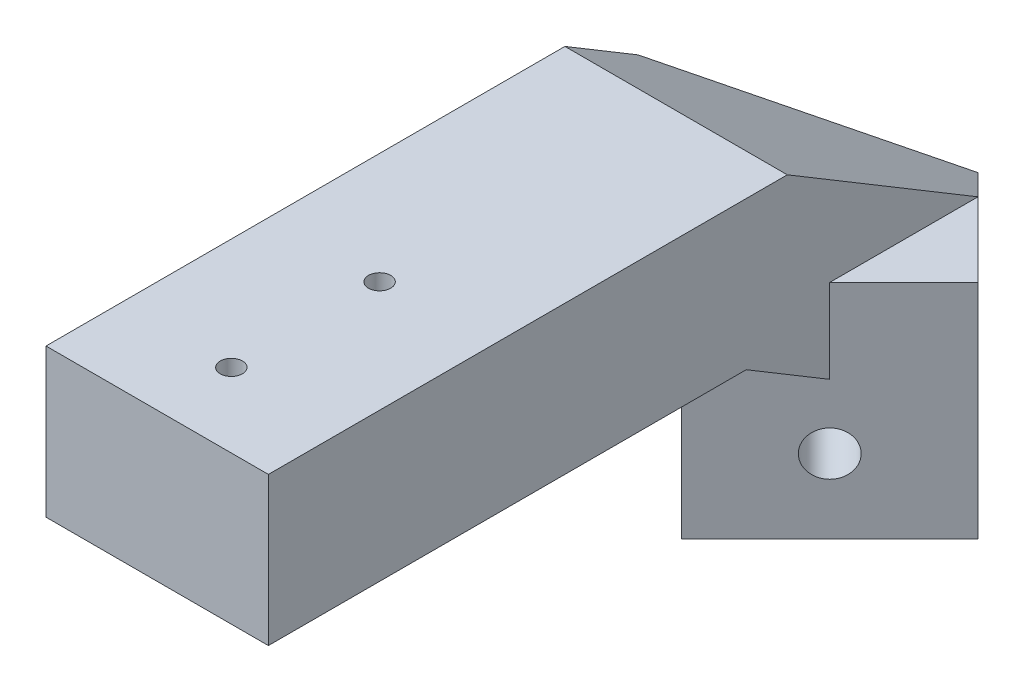
ISO-10303-21;
HEADER;
FILE_DESCRIPTION(('STEP AP214'),'2;1');
FILE_NAME('part.step','',(''),(''),'','','');
FILE_SCHEMA(('AUTOMOTIVE_DESIGN { 1 0 10303 214 1 1 1 1 }'));
ENDSEC;
DATA;
#1=APPLICATION_CONTEXT('core data for automotive mechanical design processes');
#2=APPLICATION_PROTOCOL_DEFINITION('international standard','automotive_design',2000,#1);
#3=PRODUCT_CONTEXT('',#1,'mechanical');
#4=PRODUCT('Part','Part','',(#3));
#5=PRODUCT_RELATED_PRODUCT_CATEGORY('part','',(#4));
#6=PRODUCT_DEFINITION_FORMATION('','',#4);
#7=PRODUCT_DEFINITION_CONTEXT('part definition',#1,'design');
#8=PRODUCT_DEFINITION('design','',#6,#7);
#9=PRODUCT_DEFINITION_SHAPE('','',#8);
#10=(LENGTH_UNIT() NAMED_UNIT(*) SI_UNIT(.MILLI.,.METRE.));
#11=(NAMED_UNIT(*) PLANE_ANGLE_UNIT() SI_UNIT($,.RADIAN.));
#12=(NAMED_UNIT(*) SI_UNIT($,.STERADIAN.) SOLID_ANGLE_UNIT());
#13=UNCERTAINTY_MEASURE_WITH_UNIT(LENGTH_MEASURE(1.E-05),#10,'distance_accuracy_value','');
#14=(GEOMETRIC_REPRESENTATION_CONTEXT(3) GLOBAL_UNCERTAINTY_ASSIGNED_CONTEXT((#13)) GLOBAL_UNIT_ASSIGNED_CONTEXT((#10,
#11,#12)) REPRESENTATION_CONTEXT('',''));
#15=CARTESIAN_POINT('',(0.,0.,0.));
#16=DIRECTION('',(0.,0.,1.));
#17=DIRECTION('',(1.,0.,0.));
#18=AXIS2_PLACEMENT_3D('',#15,#16,#17);
#19=CARTESIAN_POINT('',(30.,0.,0.));
#20=DIRECTION('',(0.,-1.,0.));
#21=DIRECTION('',(0.,0.,1.));
#22=AXIS2_PLACEMENT_3D('',#19,#20,#21);
#23=PLANE('',#22);
#24=CARTESIAN_POINT('',(15.,0.,-9.99999999999999));
#25=DIRECTION('',(0.,1.,0.));
#26=DIRECTION('',(0.,0.,1.));
#27=AXIS2_PLACEMENT_3D('',#24,#25,#26);
#28=CIRCLE('',#27,1.5);
#29=CARTESIAN_POINT('',(15.,0.,-8.49999999999999));
#30=VERTEX_POINT('',#29);
#31=EDGE_CURVE('E226',#30,#30,#28,.T.);
#32=ORIENTED_EDGE('',*,*,#31,.F.);
#33=EDGE_LOOP('',(#32));
#34=FACE_BOUND('',#33,.T.);
#35=CARTESIAN_POINT('',(15.,0.,10.));
#36=DIRECTION('',(0.,1.,0.));
#37=DIRECTION('',(0.,0.,1.));
#38=AXIS2_PLACEMENT_3D('',#35,#36,#37);
#39=CIRCLE('',#38,1.5);
#40=CARTESIAN_POINT('',(15.,0.,11.5));
#41=VERTEX_POINT('',#40);
#42=EDGE_CURVE('E133',#41,#41,#39,.T.);
#43=ORIENTED_EDGE('',*,*,#42,.F.);
#44=EDGE_LOOP('',(#43));
#45=FACE_BOUND('',#44,.T.);
#46=DIRECTION('',(0.,0.,-1.));
#47=VECTOR('',#46,1.);
#48=CARTESIAN_POINT('',(0.,0.,0.));
#49=LINE('',#48,#47);
#50=CARTESIAN_POINT('',(0.,0.,20.));
#51=VERTEX_POINT('',#50);
#52=CARTESIAN_POINT('',(0.,0.,-50.));
#53=VERTEX_POINT('',#52);
#54=EDGE_CURVE('E144',#51,#53,#49,.T.);
#55=ORIENTED_EDGE('',*,*,#54,.F.);
#56=DIRECTION('',(1.,0.,0.));
#57=VECTOR('',#56,1.);
#58=CARTESIAN_POINT('',(0.,0.,20.));
#59=LINE('',#58,#57);
#60=CARTESIAN_POINT('',(30.,0.,20.));
#61=VERTEX_POINT('',#60);
#62=EDGE_CURVE('E121',#51,#61,#59,.T.);
#63=ORIENTED_EDGE('',*,*,#62,.T.);
#64=DIRECTION('',(0.,0.,-1.));
#65=VECTOR('',#64,1.);
#66=CARTESIAN_POINT('',(30.,0.,0.));
#67=LINE('',#66,#65);
#68=CARTESIAN_POINT('',(30.,0.,-50.));
#69=VERTEX_POINT('',#68);
#70=EDGE_CURVE('E139',#61,#69,#67,.T.);
#71=ORIENTED_EDGE('',*,*,#70,.T.);
#72=DIRECTION('',(-1.,0.,0.));
#73=VECTOR('',#72,1.);
#74=CARTESIAN_POINT('',(30.,0.,-50.));
#75=LINE('',#74,#73);
#76=EDGE_CURVE('E150',#69,#53,#75,.T.);
#77=ORIENTED_EDGE('',*,*,#76,.T.);
#78=EDGE_LOOP('',(#55,#63,#71,#77));
#79=FACE_BOUND('',#78,.T.);
#80=ADVANCED_FACE('F32',(#34,#45,#79),#23,.F.);
#81=CARTESIAN_POINT('',(30.,0.,-50.));
#82=DIRECTION('',(0.,-0.857492925712545,0.514495755427526));
#83=DIRECTION('',(0.,0.514495755427526,0.857492925712545));
#84=AXIS2_PLACEMENT_3D('',#81,#82,#83);
#85=PLANE('',#84);
#86=ORIENTED_EDGE('',*,*,#76,.F.);
#87=DIRECTION('',(0.,-0.514495755427526,-0.857492925712544));
#88=VECTOR('',#87,1.);
#89=CARTESIAN_POINT('',(30.,0.,-50.));
#90=LINE('',#89,#88);
#91=CARTESIAN_POINT('',(30.,-15.4348726628258,-75.7247877713763));
#92=VERTEX_POINT('',#91);
#93=EDGE_CURVE('E142',#69,#92,#90,.T.);
#94=ORIENTED_EDGE('',*,*,#93,.T.);
#95=DIRECTION('',(0.650944554904121,0.390566732942471,0.650944554904118));
#96=VECTOR('',#95,1.);
#97=CARTESIAN_POINT('',(30.8474576271187,-14.9263980865546,-74.8773301442577));
#98=LINE('',#97,#96);
#99=CARTESIAN_POINT('',(22.9289321881345,-19.6775133499451,-82.7958555832418));
#100=VERTEX_POINT('',#99);
#101=EDGE_CURVE('E217',#100,#92,#98,.T.);
#102=ORIENTED_EDGE('',*,*,#101,.F.);
#103=DIRECTION('',(0.650944554904118,-0.390566732942472,-0.650944554904121));
#104=VECTOR('',#103,1.);
#105=CARTESIAN_POINT('',(-26.8724643293838,10.203324560566,-32.9944590657233));
#106=LINE('',#105,#104);
#107=CARTESIAN_POINT('',(0.,-5.92015403706431,-59.8669233951072));
#108=VERTEX_POINT('',#107);
#109=EDGE_CURVE('E11',#108,#100,#106,.T.);
#110=ORIENTED_EDGE('',*,*,#109,.F.);
#111=DIRECTION('',(0.,0.514495755427526,0.857492925712544));
#112=VECTOR('',#111,1.);
#113=CARTESIAN_POINT('',(0.,22.0588235294118,-13.235294117647));
#114=LINE('',#113,#112);
#115=EDGE_CURVE('E157',#108,#53,#114,.T.);
#116=ORIENTED_EDGE('',*,*,#115,.T.);
#117=EDGE_LOOP('',(#86,#94,#102,#110,#116));
#118=FACE_BOUND('',#117,.T.);
#119=ADVANCED_FACE('F240',(#118),#85,.F.);
#120=CARTESIAN_POINT('',(30.,-45.4348726628258,-75.7247877713763));
#121=DIRECTION('',(0.,1.,0.));
#122=DIRECTION('',(0.,0.,-1.));
#123=AXIS2_PLACEMENT_3D('',#120,#121,#122);
#124=PLANE('',#123);
#125=DIRECTION('',(-0.707106781186549,0.,-0.707106781186546));
#126=VECTOR('',#125,1.);
#127=CARTESIAN_POINT('',(40.,-45.4348726628258,-65.7247877713764));
#128=LINE('',#127,#126);
#129=CARTESIAN_POINT('',(40.,-45.4348726628258,-65.7247877713764));
#130=VERTEX_POINT('',#129);
#131=CARTESIAN_POINT('',(22.9289321881345,-45.4348726628258,-82.7958555832418));
#132=VERTEX_POINT('',#131);
#133=EDGE_CURVE('E184',#130,#132,#128,.T.);
#134=ORIENTED_EDGE('',*,*,#133,.F.);
#135=DIRECTION('',(0.707106781186546,0.,-0.707106781186549));
#136=VECTOR('',#135,1.);
#137=CARTESIAN_POINT('',(20.0000000000001,-45.4348726628258,-45.7247877713764));
#138=LINE('',#137,#136);
#139=CARTESIAN_POINT('',(20.0000000000001,-45.4348726628258,-45.7247877713764));
#140=VERTEX_POINT('',#139);
#141=EDGE_CURVE('E193',#140,#130,#138,.T.);
#142=ORIENTED_EDGE('',*,*,#141,.F.);
#143=DIRECTION('',(-0.707106781186549,0.,-0.707106781186546));
#144=VECTOR('',#143,1.);
#145=CARTESIAN_POINT('',(20.0000000000001,-45.4348726628258,-45.7247877713764));
#146=LINE('',#145,#144);
#147=CARTESIAN_POINT('',(2.9289321881346,-45.4348726628258,-62.7958555832418));
#148=VERTEX_POINT('',#147);
#149=EDGE_CURVE('E181',#140,#148,#146,.T.);
#150=ORIENTED_EDGE('',*,*,#149,.T.);
#151=DIRECTION('',(0.707106781186546,0.,-0.707106781186549));
#152=VECTOR('',#151,1.);
#153=CARTESIAN_POINT('',(2.9289321881346,-45.4348726628258,-62.7958555832418));
#154=LINE('',#153,#152);
#155=EDGE_CURVE('E202',#148,#132,#154,.T.);
#156=ORIENTED_EDGE('',*,*,#155,.T.);
#157=EDGE_LOOP('',(#134,#142,#150,#156));
#158=FACE_BOUND('',#157,.T.);
#159=ADVANCED_FACE('F260',(#158),#124,.F.);
#160=CARTESIAN_POINT('',(30.,-20.,-44.4603207010313));
#161=DIRECTION('',(0.,0.857492925712544,-0.514495755427526));
#162=DIRECTION('',(0.,-0.514495755427526,-0.857492925712545));
#163=AXIS2_PLACEMENT_3D('',#160,#161,#162);
#164=PLANE('',#163);
#165=DIRECTION('',(-0.650944554904118,0.390566732942472,0.650944554904121));
#166=VECTOR('',#165,1.);
#167=CARTESIAN_POINT('',(23.5086121967503,-22.8638475602572,-49.2333999681267));
#168=LINE('',#167,#166);
#169=CARTESIAN_POINT('',(30.,-26.758680242207,-55.7247877713763));
#170=VERTEX_POINT('',#169);
#171=CARTESIAN_POINT('',(20.0000000000001,-20.758680242207,-45.7247877713764));
#172=VERTEX_POINT('',#171);
#173=EDGE_CURVE('E174',#170,#172,#168,.T.);
#174=ORIENTED_EDGE('',*,*,#173,.F.);
#175=DIRECTION('',(0.,0.514495755427526,0.857492925712544));
#176=VECTOR('',#175,1.);
#177=CARTESIAN_POINT('',(30.,-20.,-44.4603207010313));
#178=LINE('',#177,#176);
#179=CARTESIAN_POINT('',(30.,-20.,-44.4603207010313));
#180=VERTEX_POINT('',#179);
#181=EDGE_CURVE('E165',#170,#180,#178,.T.);
#182=ORIENTED_EDGE('',*,*,#181,.T.);
#183=DIRECTION('',(-1.,0.,0.));
#184=VECTOR('',#183,1.);
#185=CARTESIAN_POINT('',(30.,-20.,-44.4603207010313));
#186=LINE('',#185,#184);
#187=CARTESIAN_POINT('',(0.,-20.,-44.4603207010313));
#188=VERTEX_POINT('',#187);
#189=EDGE_CURVE('E148',#180,#188,#186,.T.);
#190=ORIENTED_EDGE('',*,*,#189,.T.);
#191=DIRECTION('',(0.,0.514495755427526,0.857492925712544));
#192=VECTOR('',#191,1.);
#193=CARTESIAN_POINT('',(0.,-20.,-44.4603207010313));
#194=LINE('',#193,#192);
#195=CARTESIAN_POINT('',(0.,-20.7586802422069,-45.7247877713762));
#196=VERTEX_POINT('',#195);
#197=EDGE_CURVE('E137',#196,#188,#194,.T.);
#198=ORIENTED_EDGE('',*,*,#197,.F.);
#199=DIRECTION('',(-0.650944554904118,0.390566732942472,0.650944554904121));
#200=VECTOR('',#199,1.);
#201=CARTESIAN_POINT('',(11.9831884679368,-27.948593322969,-57.7079762393131));
#202=LINE('',#201,#200);
#203=CARTESIAN_POINT('',(10.0000000000001,-26.758680242207,-55.7247877713763));
#204=VERTEX_POINT('',#203);
#205=EDGE_CURVE('E159',#204,#196,#202,.T.);
#206=ORIENTED_EDGE('',*,*,#205,.F.);
#207=DIRECTION('',(-0.650944554904121,-0.390566732942471,-0.650944554904118));
#208=VECTOR('',#207,1.);
#209=CARTESIAN_POINT('',(24.9659640744362,-17.7791017975454,-40.7588236969403));
#210=LINE('',#209,#208);
#211=EDGE_CURVE('E161',#172,#204,#210,.T.);
#212=ORIENTED_EDGE('',*,*,#211,.F.);
#213=EDGE_LOOP('',(#174,#182,#190,#198,#206,#212));
#214=FACE_BOUND('',#213,.T.);
#215=ADVANCED_FACE('F251',(#214),#164,.F.);
#216=CARTESIAN_POINT('',(30.,-20.,0.));
#217=DIRECTION('',(0.,1.,0.));
#218=DIRECTION('',(0.,0.,-1.));
#219=AXIS2_PLACEMENT_3D('',#216,#217,#218);
#220=PLANE('',#219);
#221=CARTESIAN_POINT('',(15.,-20.,-9.99999999999999));
#222=DIRECTION('',(0.,1.,0.));
#223=DIRECTION('',(0.,0.,1.));
#224=AXIS2_PLACEMENT_3D('',#221,#222,#223);
#225=CIRCLE('',#224,1.5);
#226=CARTESIAN_POINT('',(15.,-20.,-8.49999999999999));
#227=VERTEX_POINT('',#226);
#228=EDGE_CURVE('E229',#227,#227,#225,.T.);
#229=ORIENTED_EDGE('',*,*,#228,.T.);
#230=EDGE_LOOP('',(#229));
#231=FACE_BOUND('',#230,.T.);
#232=CARTESIAN_POINT('',(15.,-20.,10.));
#233=DIRECTION('',(0.,1.,0.));
#234=DIRECTION('',(0.,0.,1.));
#235=AXIS2_PLACEMENT_3D('',#232,#233,#234);
#236=CIRCLE('',#235,1.5);
#237=CARTESIAN_POINT('',(15.,-20.,11.5));
#238=VERTEX_POINT('',#237);
#239=EDGE_CURVE('E223',#238,#238,#236,.T.);
#240=ORIENTED_EDGE('',*,*,#239,.T.);
#241=EDGE_LOOP('',(#240));
#242=FACE_BOUND('',#241,.T.);
#243=DIRECTION('',(0.,0.,1.));
#244=VECTOR('',#243,1.);
#245=CARTESIAN_POINT('',(0.,-20.,0.));
#246=LINE('',#245,#244);
#247=CARTESIAN_POINT('',(0.,-20.,20.));
#248=VERTEX_POINT('',#247);
#249=EDGE_CURVE('E130',#188,#248,#246,.T.);
#250=ORIENTED_EDGE('',*,*,#249,.F.);
#251=ORIENTED_EDGE('',*,*,#189,.F.);
#252=DIRECTION('',(0.,0.,1.));
#253=VECTOR('',#252,1.);
#254=CARTESIAN_POINT('',(30.,-20.,0.));
#255=LINE('',#254,#253);
#256=CARTESIAN_POINT('',(30.,-20.,20.));
#257=VERTEX_POINT('',#256);
#258=EDGE_CURVE('E132',#180,#257,#255,.T.);
#259=ORIENTED_EDGE('',*,*,#258,.T.);
#260=DIRECTION('',(-1.,0.,0.));
#261=VECTOR('',#260,1.);
#262=CARTESIAN_POINT('',(30.,-20.,20.));
#263=LINE('',#262,#261);
#264=EDGE_CURVE('E118',#257,#248,#263,.T.);
#265=ORIENTED_EDGE('',*,*,#264,.T.);
#266=EDGE_LOOP('',(#250,#251,#259,#265));
#267=FACE_BOUND('',#266,.T.);
#268=ADVANCED_FACE('F128',(#231,#242,#267),#220,.F.);
#269=CARTESIAN_POINT('',(30.,0.,0.));
#270=DIRECTION('',(1.,0.,0.));
#271=DIRECTION('',(0.,0.,1.));
#272=AXIS2_PLACEMENT_3D('',#269,#270,#271);
#273=PLANE('',#272);
#274=DIRECTION('',(0.,0.,-1.));
#275=VECTOR('',#274,1.);
#276=CARTESIAN_POINT('',(30.,-15.4348726628258,0.));
#277=LINE('',#276,#275);
#278=CARTESIAN_POINT('',(30.,-15.4348726628258,-55.7247877713763));
#279=VERTEX_POINT('',#278);
#280=EDGE_CURVE('E171',#279,#92,#277,.T.);
#281=ORIENTED_EDGE('',*,*,#280,.T.);
#282=ORIENTED_EDGE('',*,*,#93,.F.);
#283=ORIENTED_EDGE('',*,*,#70,.F.);
#284=DIRECTION('',(0.,-1.,0.));
#285=VECTOR('',#284,1.);
#286=CARTESIAN_POINT('',(30.,0.,20.));
#287=LINE('',#286,#285);
#288=EDGE_CURVE('E220',#61,#257,#287,.T.);
#289=ORIENTED_EDGE('',*,*,#288,.T.);
#290=ORIENTED_EDGE('',*,*,#258,.F.);
#291=ORIENTED_EDGE('',*,*,#181,.F.);
#292=DIRECTION('',(0.,1.,0.));
#293=VECTOR('',#292,1.);
#294=CARTESIAN_POINT('',(30.,0.,-55.7247877713763));
#295=LINE('',#294,#293);
#296=EDGE_CURVE('E177',#170,#279,#295,.T.);
#297=ORIENTED_EDGE('',*,*,#296,.T.);
#298=EDGE_LOOP('',(#281,#282,#283,#289,#290,#291,#297));
#299=FACE_BOUND('',#298,.T.);
#300=ADVANCED_FACE('F250',(#299),#273,.T.);
#301=CARTESIAN_POINT('',(0.,0.,0.));
#302=DIRECTION('',(1.,0.,0.));
#303=DIRECTION('',(0.,0.,1.));
#304=AXIS2_PLACEMENT_3D('',#301,#302,#303);
#305=PLANE('',#304);
#306=DIRECTION('',(0.,1.,0.));
#307=VECTOR('',#306,1.);
#308=CARTESIAN_POINT('',(0.,0.,-59.8669233951072));
#309=LINE('',#308,#307);
#310=CARTESIAN_POINT('',(0.,-25.0013209293262,-59.8669233951072));
#311=VERTEX_POINT('',#310);
#312=EDGE_CURVE('E39',#311,#108,#309,.T.);
#313=ORIENTED_EDGE('',*,*,#312,.F.);
#314=DIRECTION('',(0.,0.287347885566346,0.957826285221151));
#315=VECTOR('',#314,1.);
#316=CARTESIAN_POINT('',(0.,-22.7048456950139,-52.2120059473996));
#317=LINE('',#316,#315);
#318=EDGE_CURVE('E208',#311,#196,#317,.T.);
#319=ORIENTED_EDGE('',*,*,#318,.T.);
#320=ORIENTED_EDGE('',*,*,#197,.T.);
#321=ORIENTED_EDGE('',*,*,#249,.T.);
#322=DIRECTION('',(0.,1.,0.));
#323=VECTOR('',#322,1.);
#324=CARTESIAN_POINT('',(0.,-20.,20.));
#325=LINE('',#324,#323);
#326=EDGE_CURVE('E115',#248,#51,#325,.T.);
#327=ORIENTED_EDGE('',*,*,#326,.T.);
#328=ORIENTED_EDGE('',*,*,#54,.T.);
#329=ORIENTED_EDGE('',*,*,#115,.F.);
#330=EDGE_LOOP('',(#313,#319,#320,#321,#327,#328,#329));
#331=FACE_BOUND('',#330,.T.);
#332=ADVANCED_FACE('F135',(#331),#305,.F.);
#333=CARTESIAN_POINT('',(20.0000000000001,-45.4348726628258,-45.7247877713764));
#334=DIRECTION('',(-0.707106781186546,0.,0.707106781186549));
#335=DIRECTION('',(-0.707106781186549,0.,-0.707106781186546));
#336=AXIS2_PLACEMENT_3D('',#333,#334,#335);
#337=PLANE('',#336);
#338=ORIENTED_EDGE('',*,*,#211,.T.);
#339=DIRECTION('',(0.707106781186549,0.,0.707106781186546));
#340=VECTOR('',#339,1.);
#341=CARTESIAN_POINT('',(2.9289321881346,-26.758680242207,-62.7958555832418));
#342=LINE('',#341,#340);
#343=CARTESIAN_POINT('',(2.9289321881346,-26.758680242207,-62.7958555832418));
#344=VERTEX_POINT('',#343);
#345=EDGE_CURVE('E198',#344,#204,#342,.T.);
#346=ORIENTED_EDGE('',*,*,#345,.F.);
#347=DIRECTION('',(0.,-1.,0.));
#348=VECTOR('',#347,1.);
#349=CARTESIAN_POINT('',(2.9289321881346,-26.758680242207,-62.7958555832418));
#350=LINE('',#349,#348);
#351=EDGE_CURVE('E205',#344,#148,#350,.T.);
#352=ORIENTED_EDGE('',*,*,#351,.T.);
#353=ORIENTED_EDGE('',*,*,#149,.F.);
#354=DIRECTION('',(0.,-1.,0.));
#355=VECTOR('',#354,1.);
#356=CARTESIAN_POINT('',(20.0000000000001,-45.4348726628258,-45.7247877713764));
#357=LINE('',#356,#355);
#358=EDGE_CURVE('E196',#172,#140,#357,.T.);
#359=ORIENTED_EDGE('',*,*,#358,.F.);
#360=EDGE_LOOP('',(#338,#346,#352,#353,#359));
#361=FACE_BOUND('',#360,.T.);
#362=ADVANCED_FACE('F302',(#361),#337,.T.);
#363=CARTESIAN_POINT('',(-12.8623938856881,0.,-12.862393885688));
#364=DIRECTION('',(0.707106781186549,0.,0.707106781186546));
#365=DIRECTION('',(-0.707106781186546,0.,0.707106781186549));
#366=AXIS2_PLACEMENT_3D('',#363,#364,#365);
#367=PLANE('',#366);
#368=CARTESIAN_POINT('',(30.,-35.4348726628258,-55.7247877713764));
#369=DIRECTION('',(-0.707106781186549,0.,-0.707106781186546));
#370=DIRECTION('',(-0.707106781186546,0.,0.707106781186549));
#371=AXIS2_PLACEMENT_3D('',#368,#369,#370);
#372=CIRCLE('',#371,3.00000000000001);
#373=CARTESIAN_POINT('',(27.8786796564404,-35.4348726628258,-53.6034674278167));
#374=VERTEX_POINT('',#373);
#375=EDGE_CURVE('E210',#374,#374,#372,.T.);
#376=ORIENTED_EDGE('',*,*,#375,.T.);
#377=EDGE_LOOP('',(#376));
#378=FACE_BOUND('',#377,.T.);
#379=ORIENTED_EDGE('',*,*,#173,.T.);
#380=ORIENTED_EDGE('',*,*,#358,.T.);
#381=ORIENTED_EDGE('',*,*,#141,.T.);
#382=DIRECTION('',(0.,1.,0.));
#383=VECTOR('',#382,1.);
#384=CARTESIAN_POINT('',(40.,-45.4348726628258,-65.7247877713764));
#385=LINE('',#384,#383);
#386=CARTESIAN_POINT('',(40.,-15.4348726628258,-65.7247877713764));
#387=VERTEX_POINT('',#386);
#388=EDGE_CURVE('E190',#130,#387,#385,.T.);
#389=ORIENTED_EDGE('',*,*,#388,.T.);
#390=DIRECTION('',(-0.707106781186546,0.,0.707106781186549));
#391=VECTOR('',#390,1.);
#392=CARTESIAN_POINT('',(20.0000000000001,-15.4348726628258,-45.7247877713764));
#393=LINE('',#392,#391);
#394=EDGE_CURVE('E185',#387,#279,#393,.T.);
#395=ORIENTED_EDGE('',*,*,#394,.T.);
#396=ORIENTED_EDGE('',*,*,#296,.F.);
#397=EDGE_LOOP('',(#379,#380,#381,#389,#395,#396));
#398=FACE_BOUND('',#397,.T.);
#399=ADVANCED_FACE('F312',(#378,#398),#367,.T.);
#400=CARTESIAN_POINT('',(20.0000000000001,-15.4348726628258,-45.7247877713764));
#401=DIRECTION('',(0.,1.,0.));
#402=DIRECTION('',(0.,0.,-1.));
#403=AXIS2_PLACEMENT_3D('',#400,#401,#402);
#404=PLANE('',#403);
#405=ORIENTED_EDGE('',*,*,#394,.F.);
#406=DIRECTION('',(-0.707106781186549,0.,-0.707106781186546));
#407=VECTOR('',#406,1.);
#408=CARTESIAN_POINT('',(40.,-15.4348726628258,-65.7247877713764));
#409=LINE('',#408,#407);
#410=EDGE_CURVE('E180',#387,#92,#409,.T.);
#411=ORIENTED_EDGE('',*,*,#410,.T.);
#412=ORIENTED_EDGE('',*,*,#280,.F.);
#413=EDGE_LOOP('',(#405,#411,#412));
#414=FACE_BOUND('',#413,.T.);
#415=ADVANCED_FACE('F323',(#414),#404,.T.);
#416=CARTESIAN_POINT('',(40.,-45.4348726628258,-65.7247877713764));
#417=DIRECTION('',(0.707106781186546,0.,-0.707106781186549));
#418=DIRECTION('',(0.707106781186549,0.,0.707106781186546));
#419=AXIS2_PLACEMENT_3D('',#416,#417,#418);
#420=PLANE('',#419);
#421=ORIENTED_EDGE('',*,*,#101,.T.);
#422=ORIENTED_EDGE('',*,*,#410,.F.);
#423=ORIENTED_EDGE('',*,*,#388,.F.);
#424=ORIENTED_EDGE('',*,*,#133,.T.);
#425=DIRECTION('',(0.,1.,0.));
#426=VECTOR('',#425,1.);
#427=CARTESIAN_POINT('',(22.9289321881345,-45.4348726628258,-82.7958555832418));
#428=LINE('',#427,#426);
#429=EDGE_CURVE('E200',#132,#100,#428,.T.);
#430=ORIENTED_EDGE('',*,*,#429,.T.);
#431=EDGE_LOOP('',(#421,#422,#423,#424,#430));
#432=FACE_BOUND('',#431,.T.);
#433=ADVANCED_FACE('F335',(#432),#420,.T.);
#434=CARTESIAN_POINT('',(-7.07106781186549,-20.7586802422069,-52.7958555832417));
#435=DIRECTION('',(0.276172385369497,0.920574617898323,-0.276172385369498));
#436=DIRECTION('',(0.,-0.287347885566346,-0.957826285221151));
#437=AXIS2_PLACEMENT_3D('',#434,#435,#436);
#438=PLANE('',#437);
#439=DIRECTION('',(0.650944554904118,-0.390566732942472,-0.65094455490412));
#440=VECTOR('',#439,1.);
#441=CARTESIAN_POINT('',(-7.07106781186549,-20.7586802422069,-52.7958555832417));
#442=LINE('',#441,#440);
#443=EDGE_CURVE('E49',#311,#344,#442,.T.);
#444=ORIENTED_EDGE('',*,*,#443,.T.);
#445=ORIENTED_EDGE('',*,*,#345,.T.);
#446=ORIENTED_EDGE('',*,*,#205,.T.);
#447=ORIENTED_EDGE('',*,*,#318,.F.);
#448=EDGE_LOOP('',(#444,#445,#446,#447));
#449=FACE_BOUND('',#448,.T.);
#450=ADVANCED_FACE('F346',(#449),#438,.F.);
#451=CARTESIAN_POINT('',(-29.9334616975536,0.,-29.9334616975535));
#452=DIRECTION('',(-0.707106781186549,0.,-0.707106781186546));
#453=DIRECTION('',(0.707106781186546,0.,-0.707106781186549));
#454=AXIS2_PLACEMENT_3D('',#451,#452,#453);
#455=PLANE('',#454);
#456=ORIENTED_EDGE('',*,*,#109,.T.);
#457=ORIENTED_EDGE('',*,*,#429,.F.);
#458=ORIENTED_EDGE('',*,*,#155,.F.);
#459=ORIENTED_EDGE('',*,*,#351,.F.);
#460=ORIENTED_EDGE('',*,*,#443,.F.);
#461=ORIENTED_EDGE('',*,*,#312,.T.);
#462=EDGE_LOOP('',(#456,#457,#458,#459,#460,#461));
#463=FACE_BOUND('',#462,.T.);
#464=CARTESIAN_POINT('',(12.9289321881345,-35.4348726628258,-72.7958555832418));
#465=DIRECTION('',(0.707106781186549,0.,0.707106781186546));
#466=DIRECTION('',(0.707106781186546,0.,-0.707106781186549));
#467=AXIS2_PLACEMENT_3D('',#464,#465,#466);
#468=CIRCLE('',#467,3.00000000000001);
#469=CARTESIAN_POINT('',(15.0502525316942,-35.4348726628258,-74.9171759268014));
#470=VERTEX_POINT('',#469);
#471=EDGE_CURVE('E213',#470,#470,#468,.T.);
#472=ORIENTED_EDGE('',*,*,#471,.T.);
#473=EDGE_LOOP('',(#472));
#474=FACE_BOUND('',#473,.T.);
#475=ADVANCED_FACE('F356',(#463,#474),#455,.T.);
#476=CARTESIAN_POINT('',(62.8623938856882,-35.4348726628258,-22.8623938856883));
#477=DIRECTION('',(-0.707106781186549,0.,-0.707106781186546));
#478=DIRECTION('',(0.707106781186546,0.,-0.707106781186549));
#479=AXIS2_PLACEMENT_3D('',#476,#477,#478);
#480=CYLINDRICAL_SURFACE('',#479,3.00000000000001);
#481=ORIENTED_EDGE('',*,*,#375,.F.);
#482=EDGE_LOOP('',(#481));
#483=FACE_BOUND('',#482,.T.);
#484=ORIENTED_EDGE('',*,*,#471,.F.);
#485=EDGE_LOOP('',(#484));
#486=FACE_BOUND('',#485,.T.);
#487=ADVANCED_FACE('F365',(#483,#486),#480,.F.);
#488=CARTESIAN_POINT('',(0.,0.,20.));
#489=DIRECTION('',(0.,0.,1.));
#490=DIRECTION('',(-1.,0.,0.));
#491=AXIS2_PLACEMENT_3D('',#488,#489,#490);
#492=PLANE('',#491);
#493=ORIENTED_EDGE('',*,*,#264,.F.);
#494=ORIENTED_EDGE('',*,*,#288,.F.);
#495=ORIENTED_EDGE('',*,*,#62,.F.);
#496=ORIENTED_EDGE('',*,*,#326,.F.);
#497=EDGE_LOOP('',(#493,#494,#495,#496));
#498=FACE_BOUND('',#497,.T.);
#499=ADVANCED_FACE('F117',(#498),#492,.T.);
#500=CARTESIAN_POINT('',(15.,0.,10.));
#501=DIRECTION('',(0.,-1.,0.));
#502=DIRECTION('',(0.,0.,1.));
#503=AXIS2_PLACEMENT_3D('',#500,#501,#502);
#504=CYLINDRICAL_SURFACE('',#503,1.5);
#505=ORIENTED_EDGE('',*,*,#42,.T.);
#506=EDGE_LOOP('',(#505));
#507=FACE_BOUND('',#506,.T.);
#508=ORIENTED_EDGE('',*,*,#239,.F.);
#509=EDGE_LOOP('',(#508));
#510=FACE_BOUND('',#509,.T.);
#511=ADVANCED_FACE('F243',(#507,#510),#504,.F.);
#512=CARTESIAN_POINT('',(15.,0.,-9.99999999999999));
#513=DIRECTION('',(0.,-1.,0.));
#514=DIRECTION('',(0.,0.,1.));
#515=AXIS2_PLACEMENT_3D('',#512,#513,#514);
#516=CYLINDRICAL_SURFACE('',#515,1.5);
#517=ORIENTED_EDGE('',*,*,#31,.T.);
#518=EDGE_LOOP('',(#517));
#519=FACE_BOUND('',#518,.T.);
#520=ORIENTED_EDGE('',*,*,#228,.F.);
#521=EDGE_LOOP('',(#520));
#522=FACE_BOUND('',#521,.T.);
#523=ADVANCED_FACE('F235',(#519,#522),#516,.F.);
#524=CLOSED_SHELL('',(#80,#119,#159,#215,#268,#300,#332,#362,#399,#415,#433,#450,#475,#487,#499,
#511,#523));
#525=MANIFOLD_SOLID_BREP('B2',#524);
#526=ADVANCED_BREP_SHAPE_REPRESENTATION('',(#18,#525),#14);
#527=SHAPE_DEFINITION_REPRESENTATION(#9,#526);
ENDSEC;
END-ISO-10303-21;
